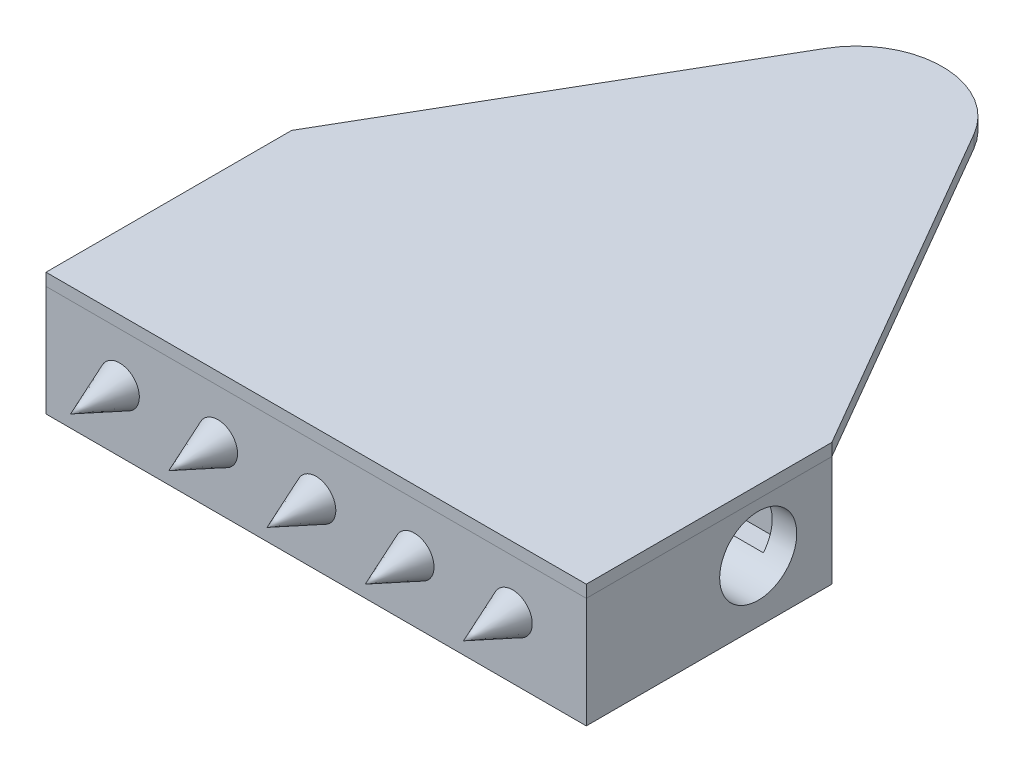
ISO-10303-21;
HEADER;
FILE_DESCRIPTION(('STEP AP214'),'2;1');
FILE_NAME('part.step','',(''),(''),'','','');
FILE_SCHEMA(('AUTOMOTIVE_DESIGN { 1 0 10303 214 1 1 1 1 }'));
ENDSEC;
DATA;
#1=APPLICATION_CONTEXT('core data for automotive mechanical design processes');
#2=APPLICATION_PROTOCOL_DEFINITION('international standard','automotive_design',2000,#1);
#3=PRODUCT_CONTEXT('',#1,'mechanical');
#4=PRODUCT('Part','Part','',(#3));
#5=PRODUCT_RELATED_PRODUCT_CATEGORY('part','',(#4));
#6=PRODUCT_DEFINITION_FORMATION('','',#4);
#7=PRODUCT_DEFINITION_CONTEXT('part definition',#1,'design');
#8=PRODUCT_DEFINITION('design','',#6,#7);
#9=PRODUCT_DEFINITION_SHAPE('','',#8);
#10=(LENGTH_UNIT() NAMED_UNIT(*) SI_UNIT(.MILLI.,.METRE.));
#11=(NAMED_UNIT(*) PLANE_ANGLE_UNIT() SI_UNIT($,.RADIAN.));
#12=(NAMED_UNIT(*) SI_UNIT($,.STERADIAN.) SOLID_ANGLE_UNIT());
#13=UNCERTAINTY_MEASURE_WITH_UNIT(LENGTH_MEASURE(1.E-05),#10,'distance_accuracy_value','');
#14=(GEOMETRIC_REPRESENTATION_CONTEXT(3) GLOBAL_UNCERTAINTY_ASSIGNED_CONTEXT((#13)) GLOBAL_UNIT_ASSIGNED_CONTEXT((#10,
#11,#12)) REPRESENTATION_CONTEXT('',''));
#15=CARTESIAN_POINT('',(0.,0.,0.));
#16=DIRECTION('',(0.,0.,1.));
#17=DIRECTION('',(1.,0.,0.));
#18=AXIS2_PLACEMENT_3D('',#15,#16,#17);
#19=CARTESIAN_POINT('',(0.,15.875,0.));
#20=DIRECTION('',(0.,-1.,0.));
#21=DIRECTION('',(0.,0.,-1.));
#22=AXIS2_PLACEMENT_3D('',#19,#20,#21);
#23=CYLINDRICAL_SURFACE('',#22,22.225);
#24=CARTESIAN_POINT('',(0.,12.7,0.));
#25=DIRECTION('',(0.,1.,0.));
#26=DIRECTION('',(0.,0.,-1.));
#27=AXIS2_PLACEMENT_3D('',#24,#25,#26);
#28=CIRCLE('',#27,22.225);
#29=CARTESIAN_POINT('',(19.2290160852544,12.7,-11.1443064114832));
#30=VERTEX_POINT('',#29);
#31=CARTESIAN_POINT('',(-19.2290160852544,12.7,-11.1443064114832));
#32=VERTEX_POINT('',#31);
#33=EDGE_CURVE('E130',#30,#32,#28,.T.);
#34=ORIENTED_EDGE('',*,*,#33,.T.);
#35=DIRECTION('',(0.,-1.,0.));
#36=VECTOR('',#35,1.);
#37=CARTESIAN_POINT('',(-19.2290160852544,15.875,-11.1443064114832));
#38=LINE('',#37,#36);
#39=CARTESIAN_POINT('',(-19.2290160852544,15.875,-11.1443064114832));
#40=VERTEX_POINT('',#39);
#41=EDGE_CURVE('E12',#40,#32,#38,.T.);
#42=ORIENTED_EDGE('',*,*,#41,.F.);
#43=CARTESIAN_POINT('',(0.,15.875,0.));
#44=DIRECTION('',(0.,1.,0.));
#45=DIRECTION('',(0.,0.,-1.));
#46=AXIS2_PLACEMENT_3D('',#43,#44,#45);
#47=CIRCLE('',#46,22.225);
#48=CARTESIAN_POINT('',(19.2290160852544,15.875,-11.1443064114832));
#49=VERTEX_POINT('',#48);
#50=EDGE_CURVE('E140',#49,#40,#47,.T.);
#51=ORIENTED_EDGE('',*,*,#50,.F.);
#52=DIRECTION('',(0.,-1.,0.));
#53=VECTOR('',#52,1.);
#54=CARTESIAN_POINT('',(19.2290160852544,15.875,-11.1443064114832));
#55=LINE('',#54,#53);
#56=EDGE_CURVE('E126',#49,#30,#55,.T.);
#57=ORIENTED_EDGE('',*,*,#56,.T.);
#58=EDGE_LOOP('',(#34,#42,#51,#57));
#59=FACE_BOUND('',#58,.T.);
#60=ADVANCED_FACE('F46',(#59),#23,.T.);
#61=CARTESIAN_POINT('',(-19.2290160852544,15.875,-11.1443064114832));
#62=DIRECTION('',(0.865197574139682,0.,0.501431109628042));
#63=DIRECTION('',(0.501431109628042,0.,-0.865197574139682));
#64=AXIS2_PLACEMENT_3D('',#61,#62,#63);
#65=PLANE('',#64);
#66=DIRECTION('',(-0.501431109628042,0.,0.865197574139682));
#67=VECTOR('',#66,1.);
#68=CARTESIAN_POINT('',(-19.2290160852544,12.7,-11.1443064114832));
#69=LINE('',#68,#67);
#70=CARTESIAN_POINT('',(-69.85,12.7,76.2));
#71=VERTEX_POINT('',#70);
#72=EDGE_CURVE('E133',#32,#71,#69,.T.);
#73=ORIENTED_EDGE('',*,*,#72,.T.);
#74=DIRECTION('',(0.,-1.,0.));
#75=VECTOR('',#74,1.);
#76=CARTESIAN_POINT('',(-69.85,15.875,76.2));
#77=LINE('',#76,#75);
#78=CARTESIAN_POINT('',(-69.85,15.875,76.2));
#79=VERTEX_POINT('',#78);
#80=EDGE_CURVE('E54',#79,#71,#77,.T.);
#81=ORIENTED_EDGE('',*,*,#80,.F.);
#82=DIRECTION('',(-0.501431109628042,0.,0.865197574139682));
#83=VECTOR('',#82,1.);
#84=CARTESIAN_POINT('',(-19.2290160852544,15.875,-11.1443064114832));
#85=LINE('',#84,#83);
#86=EDGE_CURVE('E99',#40,#79,#85,.T.);
#87=ORIENTED_EDGE('',*,*,#86,.F.);
#88=ORIENTED_EDGE('',*,*,#41,.T.);
#89=EDGE_LOOP('',(#73,#81,#87,#88));
#90=FACE_BOUND('',#89,.T.);
#91=ADVANCED_FACE('F164',(#90),#65,.F.);
#92=CARTESIAN_POINT('',(-69.85,15.875,76.2));
#93=DIRECTION('',(1.,0.,0.));
#94=DIRECTION('',(0.,0.,-1.));
#95=AXIS2_PLACEMENT_3D('',#92,#93,#94);
#96=PLANE('',#95);
#97=DIRECTION('',(0.,0.,1.));
#98=VECTOR('',#97,1.);
#99=CARTESIAN_POINT('',(-69.85,12.7,76.2));
#100=LINE('',#99,#98);
#101=CARTESIAN_POINT('',(-69.85,12.7,139.7));
#102=VERTEX_POINT('',#101);
#103=EDGE_CURVE('E135',#71,#102,#100,.T.);
#104=ORIENTED_EDGE('',*,*,#103,.T.);
#105=DIRECTION('',(0.,-1.,0.));
#106=VECTOR('',#105,1.);
#107=CARTESIAN_POINT('',(-69.85,15.875,139.7));
#108=LINE('',#107,#106);
#109=CARTESIAN_POINT('',(-69.85,15.875,139.7));
#110=VERTEX_POINT('',#109);
#111=EDGE_CURVE('E121',#110,#102,#108,.T.);
#112=ORIENTED_EDGE('',*,*,#111,.F.);
#113=DIRECTION('',(0.,0.,1.));
#114=VECTOR('',#113,1.);
#115=CARTESIAN_POINT('',(-69.85,15.875,76.2));
#116=LINE('',#115,#114);
#117=EDGE_CURVE('E112',#79,#110,#116,.T.);
#118=ORIENTED_EDGE('',*,*,#117,.F.);
#119=ORIENTED_EDGE('',*,*,#80,.T.);
#120=EDGE_LOOP('',(#104,#112,#118,#119));
#121=FACE_BOUND('',#120,.T.);
#122=ADVANCED_FACE('F146',(#121),#96,.F.);
#123=CARTESIAN_POINT('',(-69.85,15.875,139.7));
#124=DIRECTION('',(0.,0.,-1.));
#125=DIRECTION('',(-1.,0.,0.));
#126=AXIS2_PLACEMENT_3D('',#123,#124,#125);
#127=PLANE('',#126);
#128=DIRECTION('',(1.,0.,0.));
#129=VECTOR('',#128,1.);
#130=CARTESIAN_POINT('',(-69.85,12.7,139.7));
#131=LINE('',#130,#129);
#132=CARTESIAN_POINT('',(69.85,12.7,139.7));
#133=VERTEX_POINT('',#132);
#134=EDGE_CURVE('E120',#102,#133,#131,.T.);
#135=ORIENTED_EDGE('',*,*,#134,.T.);
#136=DIRECTION('',(0.,-1.,0.));
#137=VECTOR('',#136,1.);
#138=CARTESIAN_POINT('',(69.85,15.875,139.7));
#139=LINE('',#138,#137);
#140=CARTESIAN_POINT('',(69.85,15.875,139.7));
#141=VERTEX_POINT('',#140);
#142=EDGE_CURVE('E117',#141,#133,#139,.T.);
#143=ORIENTED_EDGE('',*,*,#142,.F.);
#144=DIRECTION('',(1.,0.,0.));
#145=VECTOR('',#144,1.);
#146=CARTESIAN_POINT('',(-69.85,15.875,139.7));
#147=LINE('',#146,#145);
#148=EDGE_CURVE('E106',#110,#141,#147,.T.);
#149=ORIENTED_EDGE('',*,*,#148,.F.);
#150=ORIENTED_EDGE('',*,*,#111,.T.);
#151=EDGE_LOOP('',(#135,#143,#149,#150));
#152=FACE_BOUND('',#151,.T.);
#153=ADVANCED_FACE('F118',(#152),#127,.F.);
#154=CARTESIAN_POINT('',(69.85,15.875,139.7));
#155=DIRECTION('',(-1.,0.,0.));
#156=DIRECTION('',(0.,0.,1.));
#157=AXIS2_PLACEMENT_3D('',#154,#155,#156);
#158=PLANE('',#157);
#159=DIRECTION('',(0.,0.,-1.));
#160=VECTOR('',#159,1.);
#161=CARTESIAN_POINT('',(69.85,12.7,139.7));
#162=LINE('',#161,#160);
#163=CARTESIAN_POINT('',(69.85,12.7,76.2));
#164=VERTEX_POINT('',#163);
#165=EDGE_CURVE('E85',#133,#164,#162,.T.);
#166=ORIENTED_EDGE('',*,*,#165,.T.);
#167=DIRECTION('',(0.,-1.,0.));
#168=VECTOR('',#167,1.);
#169=CARTESIAN_POINT('',(69.85,15.875,76.2));
#170=LINE('',#169,#168);
#171=CARTESIAN_POINT('',(69.85,15.875,76.2));
#172=VERTEX_POINT('',#171);
#173=EDGE_CURVE('E122',#172,#164,#170,.T.);
#174=ORIENTED_EDGE('',*,*,#173,.F.);
#175=DIRECTION('',(0.,0.,-1.));
#176=VECTOR('',#175,1.);
#177=CARTESIAN_POINT('',(69.85,15.875,139.7));
#178=LINE('',#177,#176);
#179=EDGE_CURVE('E110',#141,#172,#178,.T.);
#180=ORIENTED_EDGE('',*,*,#179,.F.);
#181=ORIENTED_EDGE('',*,*,#142,.T.);
#182=EDGE_LOOP('',(#166,#174,#180,#181));
#183=FACE_BOUND('',#182,.T.);
#184=ADVANCED_FACE('F124',(#183),#158,.F.);
#185=CARTESIAN_POINT('',(69.85,15.875,76.2));
#186=DIRECTION('',(-0.865197574139682,0.,0.501431109628042));
#187=DIRECTION('',(0.501431109628042,0.,0.865197574139682));
#188=AXIS2_PLACEMENT_3D('',#185,#186,#187);
#189=PLANE('',#188);
#190=DIRECTION('',(-0.501431109628042,0.,-0.865197574139682));
#191=VECTOR('',#190,1.);
#192=CARTESIAN_POINT('',(69.85,12.7,76.2));
#193=LINE('',#192,#191);
#194=EDGE_CURVE('E91',#164,#30,#193,.T.);
#195=ORIENTED_EDGE('',*,*,#194,.T.);
#196=ORIENTED_EDGE('',*,*,#56,.F.);
#197=DIRECTION('',(-0.501431109628042,0.,-0.865197574139682));
#198=VECTOR('',#197,1.);
#199=CARTESIAN_POINT('',(69.85,15.875,76.2));
#200=LINE('',#199,#198);
#201=EDGE_CURVE('E62',#172,#49,#200,.T.);
#202=ORIENTED_EDGE('',*,*,#201,.F.);
#203=ORIENTED_EDGE('',*,*,#173,.T.);
#204=EDGE_LOOP('',(#195,#196,#202,#203));
#205=FACE_BOUND('',#204,.T.);
#206=ADVANCED_FACE('F153',(#205),#189,.F.);
#207=CARTESIAN_POINT('',(0.,15.875,0.));
#208=DIRECTION('',(0.,-1.,0.));
#209=DIRECTION('',(0.,0.,-1.));
#210=AXIS2_PLACEMENT_3D('',#207,#208,#209);
#211=PLANE('',#210);
#212=ORIENTED_EDGE('',*,*,#50,.T.);
#213=ORIENTED_EDGE('',*,*,#86,.T.);
#214=ORIENTED_EDGE('',*,*,#117,.T.);
#215=ORIENTED_EDGE('',*,*,#148,.T.);
#216=ORIENTED_EDGE('',*,*,#179,.T.);
#217=ORIENTED_EDGE('',*,*,#201,.T.);
#218=EDGE_LOOP('',(#212,#213,#214,#215,#216,#217));
#219=FACE_BOUND('',#218,.T.);
#220=ADVANCED_FACE('F108',(#219),#211,.F.);
#221=CARTESIAN_POINT('',(0.,12.7,0.));
#222=DIRECTION('',(0.,-1.,0.));
#223=DIRECTION('',(0.,0.,-1.));
#224=AXIS2_PLACEMENT_3D('',#221,#222,#223);
#225=PLANE('',#224);
#226=ORIENTED_EDGE('',*,*,#33,.F.);
#227=ORIENTED_EDGE('',*,*,#194,.F.);
#228=ORIENTED_EDGE('',*,*,#165,.F.);
#229=ORIENTED_EDGE('',*,*,#134,.F.);
#230=ORIENTED_EDGE('',*,*,#103,.F.);
#231=ORIENTED_EDGE('',*,*,#72,.F.);
#232=EDGE_LOOP('',(#226,#227,#228,#229,#230,#231));
#233=FACE_BOUND('',#232,.T.);
#234=ADVANCED_FACE('F149',(#233),#225,.T.);
#235=CLOSED_SHELL('',(#60,#91,#122,#153,#184,#206,#220,#234));
#236=MANIFOLD_SOLID_BREP('B2',#235);
#237=CARTESIAN_POINT('',(0.,-6.35,0.));
#238=DIRECTION('',(0.,1.,0.));
#239=DIRECTION('',(0.,0.,1.));
#240=AXIS2_PLACEMENT_3D('',#237,#238,#239);
#241=PLANE('',#240);
#242=DIRECTION('',(-1.,0.,0.));
#243=VECTOR('',#242,1.);
#244=CARTESIAN_POINT('',(69.85,-6.35,87.5644011131208));
#245=LINE('',#244,#243);
#246=CARTESIAN_POINT('',(-19.05,-6.35,87.5644011131208));
#247=VERTEX_POINT('',#246);
#248=CARTESIAN_POINT('',(-63.5,-6.35,87.5644011131208));
#249=VERTEX_POINT('',#248);
#250=EDGE_CURVE('E552',#247,#249,#245,.T.);
#251=ORIENTED_EDGE('',*,*,#250,.F.);
#252=DIRECTION('',(0.,0.,-1.));
#253=VECTOR('',#252,1.);
#254=CARTESIAN_POINT('',(-19.05,-6.35,82.55));
#255=LINE('',#254,#253);
#256=CARTESIAN_POINT('',(-19.05,-6.35,82.55));
#257=VERTEX_POINT('',#256);
#258=EDGE_CURVE('E534',#247,#257,#255,.T.);
#259=ORIENTED_EDGE('',*,*,#258,.T.);
#260=DIRECTION('',(-1.,0.,0.));
#261=VECTOR('',#260,1.);
#262=CARTESIAN_POINT('',(-63.5,-6.35,82.55));
#263=LINE('',#262,#261);
#264=CARTESIAN_POINT('',(-63.5,-6.35,82.55));
#265=VERTEX_POINT('',#264);
#266=EDGE_CURVE('E536',#257,#265,#263,.T.);
#267=ORIENTED_EDGE('',*,*,#266,.T.);
#268=DIRECTION('',(0.,0.,1.));
#269=VECTOR('',#268,1.);
#270=CARTESIAN_POINT('',(-63.5,-6.35,82.55));
#271=LINE('',#270,#269);
#272=EDGE_CURVE('E522',#265,#249,#271,.T.);
#273=ORIENTED_EDGE('',*,*,#272,.T.);
#274=EDGE_LOOP('',(#251,#259,#267,#273));
#275=FACE_BOUND('',#274,.T.);
#276=ADVANCED_FACE('F221',(#275),#241,.T.);
#277=CARTESIAN_POINT('',(0.,-6.35,0.));
#278=DIRECTION('',(0.,-1.,0.));
#279=DIRECTION('',(0.,0.,-1.));
#280=AXIS2_PLACEMENT_3D('',#277,#278,#279);
#281=PLANE('',#280);
#282=DIRECTION('',(0.,0.,-1.));
#283=VECTOR('',#282,1.);
#284=CARTESIAN_POINT('',(63.5,-6.35,82.55));
#285=LINE('',#284,#283);
#286=CARTESIAN_POINT('',(63.5,-6.35,107.95));
#287=VERTEX_POINT('',#286);
#288=CARTESIAN_POINT('',(63.5,-6.35,102.935598886879));
#289=VERTEX_POINT('',#288);
#290=EDGE_CURVE('E558',#287,#289,#285,.T.);
#291=ORIENTED_EDGE('',*,*,#290,.T.);
#292=DIRECTION('',(-1.,0.,0.));
#293=VECTOR('',#292,1.);
#294=CARTESIAN_POINT('',(69.85,-6.35,102.935598886879));
#295=LINE('',#294,#293);
#296=CARTESIAN_POINT('',(19.05,-6.35,102.935598886879));
#297=VERTEX_POINT('',#296);
#298=EDGE_CURVE('E462',#289,#297,#295,.T.);
#299=ORIENTED_EDGE('',*,*,#298,.T.);
#300=DIRECTION('',(0.,0.,1.));
#301=VECTOR('',#300,1.);
#302=CARTESIAN_POINT('',(19.05,-6.35,82.55));
#303=LINE('',#302,#301);
#304=CARTESIAN_POINT('',(19.05,-6.35,107.95));
#305=VERTEX_POINT('',#304);
#306=EDGE_CURVE('E564',#297,#305,#303,.T.);
#307=ORIENTED_EDGE('',*,*,#306,.T.);
#308=DIRECTION('',(1.,0.,0.));
#309=VECTOR('',#308,1.);
#310=CARTESIAN_POINT('',(63.5,-6.35,107.95));
#311=LINE('',#310,#309);
#312=EDGE_CURVE('E568',#305,#287,#311,.T.);
#313=ORIENTED_EDGE('',*,*,#312,.T.);
#314=EDGE_LOOP('',(#291,#299,#307,#313));
#315=FACE_BOUND('',#314,.T.);
#316=ADVANCED_FACE('F479',(#315),#281,.F.);
#317=CARTESIAN_POINT('',(-63.5,12.7,82.55));
#318=DIRECTION('',(0.,0.,1.));
#319=DIRECTION('',(1.,0.,0.));
#320=AXIS2_PLACEMENT_3D('',#317,#318,#319);
#321=PLANE('',#320);
#322=DIRECTION('',(-1.,0.,0.));
#323=VECTOR('',#322,1.);
#324=CARTESIAN_POINT('',(-63.5,-12.7,82.55));
#325=LINE('',#324,#323);
#326=CARTESIAN_POINT('',(19.05,-12.7,82.55));
#327=VERTEX_POINT('',#326);
#328=CARTESIAN_POINT('',(-19.05,-12.7,82.55));
#329=VERTEX_POINT('',#328);
#330=EDGE_CURVE('E420',#327,#329,#325,.T.);
#331=ORIENTED_EDGE('',*,*,#330,.F.);
#332=DIRECTION('',(0.,-1.,0.));
#333=VECTOR('',#332,1.);
#334=CARTESIAN_POINT('',(19.05,-6.35,82.55));
#335=LINE('',#334,#333);
#336=CARTESIAN_POINT('',(19.05,-6.35,82.55));
#337=VERTEX_POINT('',#336);
#338=EDGE_CURVE('E531',#337,#327,#335,.T.);
#339=ORIENTED_EDGE('',*,*,#338,.F.);
#340=DIRECTION('',(-1.,0.,0.));
#341=VECTOR('',#340,1.);
#342=CARTESIAN_POINT('',(63.5,-6.35,82.55));
#343=LINE('',#342,#341);
#344=CARTESIAN_POINT('',(63.5,-6.35,82.55));
#345=VERTEX_POINT('',#344);
#346=EDGE_CURVE('E561',#345,#337,#343,.T.);
#347=ORIENTED_EDGE('',*,*,#346,.F.);
#348=DIRECTION('',(0.,-1.,0.));
#349=VECTOR('',#348,1.);
#350=CARTESIAN_POINT('',(63.5,12.7,82.55));
#351=LINE('',#350,#349);
#352=CARTESIAN_POINT('',(63.5,12.7,82.55));
#353=VERTEX_POINT('',#352);
#354=EDGE_CURVE('E445',#353,#345,#351,.T.);
#355=ORIENTED_EDGE('',*,*,#354,.F.);
#356=DIRECTION('',(-1.,0.,0.));
#357=VECTOR('',#356,1.);
#358=CARTESIAN_POINT('',(-63.5,12.7,82.55));
#359=LINE('',#358,#357);
#360=CARTESIAN_POINT('',(-63.5,12.7,82.55));
#361=VERTEX_POINT('',#360);
#362=EDGE_CURVE('E429',#353,#361,#359,.T.);
#363=ORIENTED_EDGE('',*,*,#362,.T.);
#364=DIRECTION('',(0.,-1.,0.));
#365=VECTOR('',#364,1.);
#366=CARTESIAN_POINT('',(-63.5,12.7,82.55));
#367=LINE('',#366,#365);
#368=EDGE_CURVE('E442',#361,#265,#367,.T.);
#369=ORIENTED_EDGE('',*,*,#368,.T.);
#370=ORIENTED_EDGE('',*,*,#266,.F.);
#371=DIRECTION('',(0.,-1.,0.));
#372=VECTOR('',#371,1.);
#373=CARTESIAN_POINT('',(-19.05,-6.35,82.55));
#374=LINE('',#373,#372);
#375=EDGE_CURVE('E539',#257,#329,#374,.T.);
#376=ORIENTED_EDGE('',*,*,#375,.T.);
#377=EDGE_LOOP('',(#331,#339,#347,#355,#363,#369,#370,#376));
#378=FACE_BOUND('',#377,.T.);
#379=ADVANCED_FACE('F486',(#378),#321,.T.);
#380=CARTESIAN_POINT('',(0.,-12.7,0.));
#381=DIRECTION('',(0.,-1.,0.));
#382=DIRECTION('',(0.,0.,-1.));
#383=AXIS2_PLACEMENT_3D('',#380,#381,#382);
#384=PLANE('',#383);
#385=DIRECTION('',(0.,0.,1.));
#386=VECTOR('',#385,1.);
#387=CARTESIAN_POINT('',(19.05,-12.7,82.55));
#388=LINE('',#387,#386);
#389=CARTESIAN_POINT('',(19.05,-12.7,107.95));
#390=VERTEX_POINT('',#389);
#391=EDGE_CURVE('E557',#327,#390,#388,.T.);
#392=ORIENTED_EDGE('',*,*,#391,.F.);
#393=ORIENTED_EDGE('',*,*,#330,.T.);
#394=DIRECTION('',(0.,0.,-1.));
#395=VECTOR('',#394,1.);
#396=CARTESIAN_POINT('',(-19.05,-12.7,82.55));
#397=LINE('',#396,#395);
#398=CARTESIAN_POINT('',(-19.05,-12.7,107.95));
#399=VERTEX_POINT('',#398);
#400=EDGE_CURVE('E523',#399,#329,#397,.T.);
#401=ORIENTED_EDGE('',*,*,#400,.F.);
#402=DIRECTION('',(1.,0.,0.));
#403=VECTOR('',#402,1.);
#404=CARTESIAN_POINT('',(-63.5,-12.7,107.95));
#405=LINE('',#404,#403);
#406=CARTESIAN_POINT('',(-63.5,-12.7,107.95));
#407=VERTEX_POINT('',#406);
#408=EDGE_CURVE('E527',#407,#399,#405,.T.);
#409=ORIENTED_EDGE('',*,*,#408,.F.);
#410=DIRECTION('',(0.,0.,1.));
#411=VECTOR('',#410,1.);
#412=CARTESIAN_POINT('',(-63.5,-12.7,82.55));
#413=LINE('',#412,#411);
#414=CARTESIAN_POINT('',(-63.5,-12.7,133.35));
#415=VERTEX_POINT('',#414);
#416=EDGE_CURVE('E422',#407,#415,#413,.T.);
#417=ORIENTED_EDGE('',*,*,#416,.T.);
#418=DIRECTION('',(1.,0.,0.));
#419=VECTOR('',#418,1.);
#420=CARTESIAN_POINT('',(-63.5,-12.7,133.35));
#421=LINE('',#420,#419);
#422=CARTESIAN_POINT('',(63.5,-12.7,133.35));
#423=VERTEX_POINT('',#422);
#424=EDGE_CURVE('E424',#415,#423,#421,.T.);
#425=ORIENTED_EDGE('',*,*,#424,.T.);
#426=DIRECTION('',(0.,0.,-1.));
#427=VECTOR('',#426,1.);
#428=CARTESIAN_POINT('',(63.5,-12.7,82.55));
#429=LINE('',#428,#427);
#430=CARTESIAN_POINT('',(63.5,-12.7,107.95));
#431=VERTEX_POINT('',#430);
#432=EDGE_CURVE('E414',#423,#431,#429,.T.);
#433=ORIENTED_EDGE('',*,*,#432,.T.);
#434=DIRECTION('',(1.,0.,0.));
#435=VECTOR('',#434,1.);
#436=CARTESIAN_POINT('',(63.5,-12.7,107.95));
#437=LINE('',#436,#435);
#438=EDGE_CURVE('E573',#390,#431,#437,.T.);
#439=ORIENTED_EDGE('',*,*,#438,.F.);
#440=EDGE_LOOP('',(#392,#393,#401,#409,#417,#425,#433,#439));
#441=FACE_BOUND('',#440,.T.);
#442=ADVANCED_FACE('F591',(#441),#384,.F.);
#443=CARTESIAN_POINT('',(63.5,12.7,82.55));
#444=DIRECTION('',(-1.,0.,0.));
#445=DIRECTION('',(0.,0.,1.));
#446=AXIS2_PLACEMENT_3D('',#443,#444,#445);
#447=PLANE('',#446);
#448=CARTESIAN_POINT('',(63.5,0.,95.2500000000001));
#449=DIRECTION('',(-1.,0.,0.));
#450=DIRECTION('',(0.,0.,1.));
#451=AXIS2_PLACEMENT_3D('',#448,#449,#450);
#452=CIRCLE('',#451,9.9695);
#453=CARTESIAN_POINT('',(63.5,-6.35,87.5644011131208));
#454=VERTEX_POINT('',#453);
#455=EDGE_CURVE('E244',#289,#454,#452,.T.);
#456=ORIENTED_EDGE('',*,*,#455,.F.);
#457=ORIENTED_EDGE('',*,*,#290,.F.);
#458=DIRECTION('',(0.,-1.,0.));
#459=VECTOR('',#458,1.);
#460=CARTESIAN_POINT('',(63.5,-6.35,107.95));
#461=LINE('',#460,#459);
#462=EDGE_CURVE('E571',#287,#431,#461,.T.);
#463=ORIENTED_EDGE('',*,*,#462,.T.);
#464=ORIENTED_EDGE('',*,*,#432,.F.);
#465=DIRECTION('',(0.,-1.,0.));
#466=VECTOR('',#465,1.);
#467=CARTESIAN_POINT('',(63.5,12.7,133.35));
#468=LINE('',#467,#466);
#469=CARTESIAN_POINT('',(63.5,12.7,133.35));
#470=VERTEX_POINT('',#469);
#471=EDGE_CURVE('E436',#470,#423,#468,.T.);
#472=ORIENTED_EDGE('',*,*,#471,.F.);
#473=DIRECTION('',(0.,0.,-1.));
#474=VECTOR('',#473,1.);
#475=CARTESIAN_POINT('',(63.5,12.7,82.55));
#476=LINE('',#475,#474);
#477=EDGE_CURVE('E427',#470,#353,#476,.T.);
#478=ORIENTED_EDGE('',*,*,#477,.T.);
#479=ORIENTED_EDGE('',*,*,#354,.T.);
#480=EDGE_CURVE('E562',#454,#345,#285,.T.);
#481=ORIENTED_EDGE('',*,*,#480,.F.);
#482=EDGE_LOOP('',(#456,#457,#463,#464,#472,#478,#479,#481));
#483=FACE_BOUND('',#482,.T.);
#484=ADVANCED_FACE('F600',(#483),#447,.T.);
#485=CARTESIAN_POINT('',(-63.5,12.7,82.55));
#486=DIRECTION('',(1.,0.,0.));
#487=DIRECTION('',(0.,0.,-1.));
#488=AXIS2_PLACEMENT_3D('',#485,#486,#487);
#489=PLANE('',#488);
#490=CARTESIAN_POINT('',(-63.5,0.,95.25));
#491=DIRECTION('',(1.,0.,0.));
#492=DIRECTION('',(0.,0.,-1.));
#493=AXIS2_PLACEMENT_3D('',#490,#491,#492);
#494=CIRCLE('',#493,9.9695);
#495=CARTESIAN_POINT('',(-63.5,-6.35,102.935598886879));
#496=VERTEX_POINT('',#495);
#497=EDGE_CURVE('E236',#249,#496,#494,.T.);
#498=ORIENTED_EDGE('',*,*,#497,.F.);
#499=ORIENTED_EDGE('',*,*,#272,.F.);
#500=ORIENTED_EDGE('',*,*,#368,.F.);
#501=DIRECTION('',(0.,0.,1.));
#502=VECTOR('',#501,1.);
#503=CARTESIAN_POINT('',(-63.5,12.7,82.55));
#504=LINE('',#503,#502);
#505=CARTESIAN_POINT('',(-63.5,12.7,133.35));
#506=VERTEX_POINT('',#505);
#507=EDGE_CURVE('E431',#361,#506,#504,.T.);
#508=ORIENTED_EDGE('',*,*,#507,.T.);
#509=DIRECTION('',(0.,-1.,0.));
#510=VECTOR('',#509,1.);
#511=CARTESIAN_POINT('',(-63.5,12.7,133.35));
#512=LINE('',#511,#510);
#513=EDGE_CURVE('E439',#506,#415,#512,.T.);
#514=ORIENTED_EDGE('',*,*,#513,.T.);
#515=ORIENTED_EDGE('',*,*,#416,.F.);
#516=DIRECTION('',(0.,-1.,0.));
#517=VECTOR('',#516,1.);
#518=CARTESIAN_POINT('',(-63.5,-6.35,107.95));
#519=LINE('',#518,#517);
#520=CARTESIAN_POINT('',(-63.5,-6.35,107.95));
#521=VERTEX_POINT('',#520);
#522=EDGE_CURVE('E520',#521,#407,#519,.T.);
#523=ORIENTED_EDGE('',*,*,#522,.F.);
#524=EDGE_CURVE('E508',#496,#521,#271,.T.);
#525=ORIENTED_EDGE('',*,*,#524,.F.);
#526=EDGE_LOOP('',(#498,#499,#500,#508,#514,#515,#523,#525));
#527=FACE_BOUND('',#526,.T.);
#528=ADVANCED_FACE('F516',(#527),#489,.T.);
#529=CARTESIAN_POINT('',(0.,12.7,0.));
#530=DIRECTION('',(0.,-1.,0.));
#531=DIRECTION('',(0.,0.,-1.));
#532=AXIS2_PLACEMENT_3D('',#529,#530,#531);
#533=PLANE('',#532);
#534=DIRECTION('',(0.,0.,-1.));
#535=VECTOR('',#534,1.);
#536=CARTESIAN_POINT('',(69.85,12.7,139.7));
#537=LINE('',#536,#535);
#538=CARTESIAN_POINT('',(69.85,12.7,139.7));
#539=VERTEX_POINT('',#538);
#540=CARTESIAN_POINT('',(69.85,12.7,76.2));
#541=VERTEX_POINT('',#540);
#542=EDGE_CURVE('E448',#539,#541,#537,.T.);
#543=ORIENTED_EDGE('',*,*,#542,.T.);
#544=DIRECTION('',(-1.,0.,0.));
#545=VECTOR('',#544,1.);
#546=CARTESIAN_POINT('',(-69.85,12.7,76.2));
#547=LINE('',#546,#545);
#548=CARTESIAN_POINT('',(-69.85,12.7,76.2));
#549=VERTEX_POINT('',#548);
#550=EDGE_CURVE('E451',#541,#549,#547,.T.);
#551=ORIENTED_EDGE('',*,*,#550,.T.);
#552=DIRECTION('',(0.,0.,1.));
#553=VECTOR('',#552,1.);
#554=CARTESIAN_POINT('',(-69.85,12.7,139.7));
#555=LINE('',#554,#553);
#556=CARTESIAN_POINT('',(-69.85,12.7,139.7));
#557=VERTEX_POINT('',#556);
#558=EDGE_CURVE('E453',#549,#557,#555,.T.);
#559=ORIENTED_EDGE('',*,*,#558,.T.);
#560=DIRECTION('',(1.,0.,0.));
#561=VECTOR('',#560,1.);
#562=CARTESIAN_POINT('',(-69.85,12.7,139.7));
#563=LINE('',#562,#561);
#564=EDGE_CURVE('E395',#557,#539,#563,.T.);
#565=ORIENTED_EDGE('',*,*,#564,.T.);
#566=EDGE_LOOP('',(#543,#551,#559,#565));
#567=FACE_BOUND('',#566,.T.);
#568=ORIENTED_EDGE('',*,*,#477,.F.);
#569=DIRECTION('',(1.,0.,0.));
#570=VECTOR('',#569,1.);
#571=CARTESIAN_POINT('',(-63.5,12.7,133.35));
#572=LINE('',#571,#570);
#573=EDGE_CURVE('E434',#506,#470,#572,.T.);
#574=ORIENTED_EDGE('',*,*,#573,.F.);
#575=ORIENTED_EDGE('',*,*,#507,.F.);
#576=ORIENTED_EDGE('',*,*,#362,.F.);
#577=EDGE_LOOP('',(#568,#574,#575,#576));
#578=FACE_BOUND('',#577,.T.);
#579=ADVANCED_FACE('F611',(#567,#578),#533,.F.);
#580=CARTESIAN_POINT('',(69.85,12.7,139.7));
#581=DIRECTION('',(-1.,0.,0.));
#582=DIRECTION('',(0.,0.,1.));
#583=AXIS2_PLACEMENT_3D('',#580,#581,#582);
#584=PLANE('',#583);
#585=CARTESIAN_POINT('',(69.85,0.,95.2500000000001));
#586=DIRECTION('',(-1.,0.,0.));
#587=DIRECTION('',(0.,0.,1.));
#588=AXIS2_PLACEMENT_3D('',#585,#586,#587);
#589=CIRCLE('',#588,9.9695);
#590=CARTESIAN_POINT('',(69.85,0.,105.2195));
#591=VERTEX_POINT('',#590);
#592=EDGE_CURVE('E604',#591,#591,#589,.T.);
#593=ORIENTED_EDGE('',*,*,#592,.T.);
#594=EDGE_LOOP('',(#593));
#595=FACE_BOUND('',#594,.T.);
#596=DIRECTION('',(0.,-1.,0.));
#597=VECTOR('',#596,1.);
#598=CARTESIAN_POINT('',(69.85,12.7,139.7));
#599=LINE('',#598,#597);
#600=CARTESIAN_POINT('',(69.85,-15.875,139.7));
#601=VERTEX_POINT('',#600);
#602=EDGE_CURVE('E400',#539,#601,#599,.T.);
#603=ORIENTED_EDGE('',*,*,#602,.T.);
#604=DIRECTION('',(0.,0.,1.));
#605=VECTOR('',#604,1.);
#606=CARTESIAN_POINT('',(69.85,-15.875,139.7));
#607=LINE('',#606,#605);
#608=CARTESIAN_POINT('',(69.85,-15.875,76.2));
#609=VERTEX_POINT('',#608);
#610=EDGE_CURVE('E409',#609,#601,#607,.T.);
#611=ORIENTED_EDGE('',*,*,#610,.F.);
#612=DIRECTION('',(0.,-1.,0.));
#613=VECTOR('',#612,1.);
#614=CARTESIAN_POINT('',(69.85,12.7,76.2));
#615=LINE('',#614,#613);
#616=EDGE_CURVE('E458',#541,#609,#615,.T.);
#617=ORIENTED_EDGE('',*,*,#616,.F.);
#618=ORIENTED_EDGE('',*,*,#542,.F.);
#619=EDGE_LOOP('',(#603,#611,#617,#618));
#620=FACE_BOUND('',#619,.T.);
#621=ADVANCED_FACE('F223',(#595,#620),#584,.F.);
#622=CARTESIAN_POINT('',(-69.85,12.7,76.2));
#623=DIRECTION('',(0.,0.,1.));
#624=DIRECTION('',(1.,0.,0.));
#625=AXIS2_PLACEMENT_3D('',#622,#623,#624);
#626=PLANE('',#625);
#627=ORIENTED_EDGE('',*,*,#616,.T.);
#628=DIRECTION('',(1.,0.,0.));
#629=VECTOR('',#628,1.);
#630=CARTESIAN_POINT('',(-69.85,-15.875,76.2));
#631=LINE('',#630,#629);
#632=CARTESIAN_POINT('',(-69.85,-15.875,76.2));
#633=VERTEX_POINT('',#632);
#634=EDGE_CURVE('E412',#633,#609,#631,.T.);
#635=ORIENTED_EDGE('',*,*,#634,.F.);
#636=DIRECTION('',(0.,-1.,0.));
#637=VECTOR('',#636,1.);
#638=CARTESIAN_POINT('',(-69.85,12.7,76.2));
#639=LINE('',#638,#637);
#640=EDGE_CURVE('E399',#549,#633,#639,.T.);
#641=ORIENTED_EDGE('',*,*,#640,.F.);
#642=ORIENTED_EDGE('',*,*,#550,.F.);
#643=EDGE_LOOP('',(#627,#635,#641,#642));
#644=FACE_BOUND('',#643,.T.);
#645=ADVANCED_FACE('F745',(#644),#626,.F.);
#646=CARTESIAN_POINT('',(-69.85,12.7,139.7));
#647=DIRECTION('',(1.,0.,0.));
#648=DIRECTION('',(0.,0.,-1.));
#649=AXIS2_PLACEMENT_3D('',#646,#647,#648);
#650=PLANE('',#649);
#651=CARTESIAN_POINT('',(-69.85,0.,95.25));
#652=DIRECTION('',(-1.,0.,0.));
#653=DIRECTION('',(0.,0.,1.));
#654=AXIS2_PLACEMENT_3D('',#651,#652,#653);
#655=CIRCLE('',#654,9.9695);
#656=CARTESIAN_POINT('',(-69.85,0.,105.2195));
#657=VERTEX_POINT('',#656);
#658=EDGE_CURVE('E620',#657,#657,#655,.T.);
#659=ORIENTED_EDGE('',*,*,#658,.F.);
#660=EDGE_LOOP('',(#659));
#661=FACE_BOUND('',#660,.T.);
#662=ORIENTED_EDGE('',*,*,#640,.T.);
#663=DIRECTION('',(0.,0.,-1.));
#664=VECTOR('',#663,1.);
#665=CARTESIAN_POINT('',(-69.85,-15.875,139.7));
#666=LINE('',#665,#664);
#667=CARTESIAN_POINT('',(-69.85,-15.875,139.7));
#668=VERTEX_POINT('',#667);
#669=EDGE_CURVE('E406',#668,#633,#666,.T.);
#670=ORIENTED_EDGE('',*,*,#669,.F.);
#671=DIRECTION('',(0.,-1.,0.));
#672=VECTOR('',#671,1.);
#673=CARTESIAN_POINT('',(-69.85,12.7,139.7));
#674=LINE('',#673,#672);
#675=EDGE_CURVE('E390',#557,#668,#674,.T.);
#676=ORIENTED_EDGE('',*,*,#675,.F.);
#677=ORIENTED_EDGE('',*,*,#558,.F.);
#678=EDGE_LOOP('',(#662,#670,#676,#677));
#679=FACE_BOUND('',#678,.T.);
#680=ADVANCED_FACE('F370',(#661,#679),#650,.F.);
#681=CARTESIAN_POINT('',(-69.85,12.7,139.7));
#682=DIRECTION('',(0.,0.,-1.));
#683=DIRECTION('',(-1.,0.,0.));
#684=AXIS2_PLACEMENT_3D('',#681,#682,#683);
#685=PLANE('',#684);
#686=CARTESIAN_POINT('',(-50.8,0.,139.7));
#687=DIRECTION('',(0.,0.,-1.));
#688=DIRECTION('',(-1.,0.,0.));
#689=AXIS2_PLACEMENT_3D('',#686,#687,#688);
#690=CIRCLE('',#689,5.08);
#691=CARTESIAN_POINT('',(-55.88,0.,139.7));
#692=VERTEX_POINT('',#691);
#693=EDGE_CURVE('E44',#692,#692,#690,.F.);
#694=ORIENTED_EDGE('',*,*,#693,.F.);
#695=EDGE_LOOP('',(#694));
#696=FACE_BOUND('',#695,.T.);
#697=CARTESIAN_POINT('',(-25.4,0.,139.7));
#698=DIRECTION('',(0.,0.,-1.));
#699=DIRECTION('',(-1.,0.,0.));
#700=AXIS2_PLACEMENT_3D('',#697,#698,#699);
#701=CIRCLE('',#700,5.08);
#702=CARTESIAN_POINT('',(-30.48,0.,139.7));
#703=VERTEX_POINT('',#702);
#704=EDGE_CURVE('E229',#703,#703,#701,.F.);
#705=ORIENTED_EDGE('',*,*,#704,.F.);
#706=EDGE_LOOP('',(#705));
#707=FACE_BOUND('',#706,.T.);
#708=CARTESIAN_POINT('',(50.8,0.,139.7));
#709=DIRECTION('',(0.,0.,-1.));
#710=DIRECTION('',(-1.,0.,0.));
#711=AXIS2_PLACEMENT_3D('',#708,#709,#710);
#712=CIRCLE('',#711,5.08);
#713=CARTESIAN_POINT('',(45.72,0.,139.7));
#714=VERTEX_POINT('',#713);
#715=EDGE_CURVE('E378',#714,#714,#712,.F.);
#716=ORIENTED_EDGE('',*,*,#715,.F.);
#717=EDGE_LOOP('',(#716));
#718=FACE_BOUND('',#717,.T.);
#719=CARTESIAN_POINT('',(25.4,0.,139.7));
#720=DIRECTION('',(0.,0.,-1.));
#721=DIRECTION('',(-1.,0.,0.));
#722=AXIS2_PLACEMENT_3D('',#719,#720,#721);
#723=CIRCLE('',#722,5.08);
#724=CARTESIAN_POINT('',(20.32,0.,139.7));
#725=VERTEX_POINT('',#724);
#726=EDGE_CURVE('E382',#725,#725,#723,.F.);
#727=ORIENTED_EDGE('',*,*,#726,.F.);
#728=EDGE_LOOP('',(#727));
#729=FACE_BOUND('',#728,.T.);
#730=CARTESIAN_POINT('',(0.,0.,139.7));
#731=DIRECTION('',(0.,0.,-1.));
#732=DIRECTION('',(-1.,0.,0.));
#733=AXIS2_PLACEMENT_3D('',#730,#731,#732);
#734=CIRCLE('',#733,5.08);
#735=CARTESIAN_POINT('',(-5.08,0.,139.7));
#736=VERTEX_POINT('',#735);
#737=EDGE_CURVE('E386',#736,#736,#734,.F.);
#738=ORIENTED_EDGE('',*,*,#737,.F.);
#739=EDGE_LOOP('',(#738));
#740=FACE_BOUND('',#739,.T.);
#741=ORIENTED_EDGE('',*,*,#675,.T.);
#742=DIRECTION('',(-1.,0.,0.));
#743=VECTOR('',#742,1.);
#744=CARTESIAN_POINT('',(-69.85,-15.875,139.7));
#745=LINE('',#744,#743);
#746=EDGE_CURVE('E393',#601,#668,#745,.T.);
#747=ORIENTED_EDGE('',*,*,#746,.F.);
#748=ORIENTED_EDGE('',*,*,#602,.F.);
#749=ORIENTED_EDGE('',*,*,#564,.F.);
#750=EDGE_LOOP('',(#741,#747,#748,#749));
#751=FACE_BOUND('',#750,.T.);
#752=ADVANCED_FACE('F366',(#696,#707,#718,#729,#740,#751),#685,.F.);
#753=CARTESIAN_POINT('',(-63.5,12.7,133.35));
#754=DIRECTION('',(0.,0.,-1.));
#755=DIRECTION('',(-1.,0.,0.));
#756=AXIS2_PLACEMENT_3D('',#753,#754,#755);
#757=PLANE('',#756);
#758=ORIENTED_EDGE('',*,*,#471,.T.);
#759=ORIENTED_EDGE('',*,*,#424,.F.);
#760=ORIENTED_EDGE('',*,*,#513,.F.);
#761=ORIENTED_EDGE('',*,*,#573,.T.);
#762=EDGE_LOOP('',(#758,#759,#760,#761));
#763=FACE_BOUND('',#762,.T.);
#764=ADVANCED_FACE('F369',(#763),#757,.T.);
#765=CARTESIAN_POINT('',(0.,-15.875,0.));
#766=DIRECTION('',(0.,-1.,0.));
#767=DIRECTION('',(0.,0.,-1.));
#768=AXIS2_PLACEMENT_3D('',#765,#766,#767);
#769=PLANE('',#768);
#770=ORIENTED_EDGE('',*,*,#610,.T.);
#771=ORIENTED_EDGE('',*,*,#746,.T.);
#772=ORIENTED_EDGE('',*,*,#669,.T.);
#773=ORIENTED_EDGE('',*,*,#634,.T.);
#774=EDGE_LOOP('',(#770,#771,#772,#773));
#775=FACE_BOUND('',#774,.T.);
#776=ADVANCED_FACE('F404',(#775),#769,.T.);
#777=CARTESIAN_POINT('',(-63.5,-6.35,107.95));
#778=DIRECTION('',(0.,0.,-1.));
#779=DIRECTION('',(-1.,0.,0.));
#780=AXIS2_PLACEMENT_3D('',#777,#778,#779);
#781=PLANE('',#780);
#782=ORIENTED_EDGE('',*,*,#408,.T.);
#783=DIRECTION('',(0.,-1.,0.));
#784=VECTOR('',#783,1.);
#785=CARTESIAN_POINT('',(-19.05,-6.35,107.95));
#786=LINE('',#785,#784);
#787=CARTESIAN_POINT('',(-19.05,-6.35,107.95));
#788=VERTEX_POINT('',#787);
#789=EDGE_CURVE('E544',#788,#399,#786,.T.);
#790=ORIENTED_EDGE('',*,*,#789,.F.);
#791=DIRECTION('',(1.,0.,0.));
#792=VECTOR('',#791,1.);
#793=CARTESIAN_POINT('',(-63.5,-6.35,107.95));
#794=LINE('',#793,#792);
#795=EDGE_CURVE('E525',#521,#788,#794,.T.);
#796=ORIENTED_EDGE('',*,*,#795,.F.);
#797=ORIENTED_EDGE('',*,*,#522,.T.);
#798=EDGE_LOOP('',(#782,#790,#796,#797));
#799=FACE_BOUND('',#798,.T.);
#800=ADVANCED_FACE('F503',(#799),#781,.F.);
#801=CARTESIAN_POINT('',(-19.05,-6.35,82.55));
#802=DIRECTION('',(-1.,0.,0.));
#803=DIRECTION('',(0.,0.,1.));
#804=AXIS2_PLACEMENT_3D('',#801,#802,#803);
#805=PLANE('',#804);
#806=ORIENTED_EDGE('',*,*,#258,.F.);
#807=CARTESIAN_POINT('',(-19.05,0.,95.25));
#808=DIRECTION('',(-1.,0.,0.));
#809=DIRECTION('',(0.,0.,1.));
#810=AXIS2_PLACEMENT_3D('',#807,#808,#809);
#811=CIRCLE('',#810,9.9695);
#812=CARTESIAN_POINT('',(-19.05,-6.35,102.935598886879));
#813=VERTEX_POINT('',#812);
#814=EDGE_CURVE('E513',#247,#813,#811,.T.);
#815=ORIENTED_EDGE('',*,*,#814,.T.);
#816=EDGE_CURVE('E511',#788,#813,#255,.T.);
#817=ORIENTED_EDGE('',*,*,#816,.F.);
#818=ORIENTED_EDGE('',*,*,#789,.T.);
#819=ORIENTED_EDGE('',*,*,#400,.T.);
#820=ORIENTED_EDGE('',*,*,#375,.F.);
#821=EDGE_LOOP('',(#806,#815,#817,#818,#819,#820));
#822=FACE_BOUND('',#821,.T.);
#823=ADVANCED_FACE('F495',(#822),#805,.F.);
#824=DIRECTION('',(-1.,0.,0.));
#825=VECTOR('',#824,1.);
#826=CARTESIAN_POINT('',(69.85,-6.35,102.935598886879));
#827=LINE('',#826,#825);
#828=EDGE_CURVE('E506',#496,#813,#827,.F.);
#829=ORIENTED_EDGE('',*,*,#828,.F.);
#830=ORIENTED_EDGE('',*,*,#524,.T.);
#831=ORIENTED_EDGE('',*,*,#795,.T.);
#832=ORIENTED_EDGE('',*,*,#816,.T.);
#833=EDGE_LOOP('',(#829,#830,#831,#832));
#834=FACE_BOUND('',#833,.T.);
#835=ADVANCED_FACE('F482',(#834),#241,.T.);
#836=CARTESIAN_POINT('',(19.05,-6.35,82.55));
#837=DIRECTION('',(1.,0.,0.));
#838=DIRECTION('',(0.,0.,-1.));
#839=AXIS2_PLACEMENT_3D('',#836,#837,#838);
#840=PLANE('',#839);
#841=ORIENTED_EDGE('',*,*,#306,.F.);
#842=CARTESIAN_POINT('',(19.05,0.,95.25));
#843=DIRECTION('',(1.,0.,0.));
#844=DIRECTION('',(0.,0.,-1.));
#845=AXIS2_PLACEMENT_3D('',#842,#843,#844);
#846=CIRCLE('',#845,9.9695);
#847=CARTESIAN_POINT('',(19.05,-6.35,87.5644011131208));
#848=VERTEX_POINT('',#847);
#849=EDGE_CURVE('E603',#297,#848,#846,.T.);
#850=ORIENTED_EDGE('',*,*,#849,.T.);
#851=EDGE_CURVE('E565',#337,#848,#303,.T.);
#852=ORIENTED_EDGE('',*,*,#851,.F.);
#853=ORIENTED_EDGE('',*,*,#338,.T.);
#854=ORIENTED_EDGE('',*,*,#391,.T.);
#855=DIRECTION('',(0.,-1.,0.));
#856=VECTOR('',#855,1.);
#857=CARTESIAN_POINT('',(19.05,-6.35,107.95));
#858=LINE('',#857,#856);
#859=EDGE_CURVE('E576',#305,#390,#858,.T.);
#860=ORIENTED_EDGE('',*,*,#859,.F.);
#861=EDGE_LOOP('',(#841,#850,#852,#853,#854,#860));
#862=FACE_BOUND('',#861,.T.);
#863=ADVANCED_FACE('F494',(#862),#840,.F.);
#864=CARTESIAN_POINT('',(63.5,-6.35,107.95));
#865=DIRECTION('',(0.,0.,-1.));
#866=DIRECTION('',(-1.,0.,0.));
#867=AXIS2_PLACEMENT_3D('',#864,#865,#866);
#868=PLANE('',#867);
#869=ORIENTED_EDGE('',*,*,#438,.T.);
#870=ORIENTED_EDGE('',*,*,#462,.F.);
#871=ORIENTED_EDGE('',*,*,#312,.F.);
#872=ORIENTED_EDGE('',*,*,#859,.T.);
#873=EDGE_LOOP('',(#869,#870,#871,#872));
#874=FACE_BOUND('',#873,.T.);
#875=ADVANCED_FACE('F501',(#874),#868,.F.);
#876=ORIENTED_EDGE('',*,*,#851,.T.);
#877=DIRECTION('',(-1.,0.,0.));
#878=VECTOR('',#877,1.);
#879=CARTESIAN_POINT('',(69.85,-6.35,87.5644011131208));
#880=LINE('',#879,#878);
#881=EDGE_CURVE('E460',#848,#454,#880,.F.);
#882=ORIENTED_EDGE('',*,*,#881,.T.);
#883=ORIENTED_EDGE('',*,*,#480,.T.);
#884=ORIENTED_EDGE('',*,*,#346,.T.);
#885=EDGE_LOOP('',(#876,#882,#883,#884));
#886=FACE_BOUND('',#885,.T.);
#887=ADVANCED_FACE('F489',(#886),#281,.F.);
#888=CARTESIAN_POINT('',(69.85,0.,95.2500000000001));
#889=DIRECTION('',(-1.,0.,0.));
#890=DIRECTION('',(0.,0.,1.));
#891=AXIS2_PLACEMENT_3D('',#888,#889,#890);
#892=CYLINDRICAL_SURFACE('',#891,9.9695);
#893=ORIENTED_EDGE('',*,*,#592,.F.);
#894=EDGE_LOOP('',(#893));
#895=FACE_BOUND('',#894,.T.);
#896=ORIENTED_EDGE('',*,*,#455,.T.);
#897=ORIENTED_EDGE('',*,*,#881,.F.);
#898=ORIENTED_EDGE('',*,*,#849,.F.);
#899=ORIENTED_EDGE('',*,*,#298,.F.);
#900=EDGE_LOOP('',(#896,#897,#898,#899));
#901=FACE_BOUND('',#900,.T.);
#902=ADVANCED_FACE('F616',(#895,#901),#892,.F.);
#903=ORIENTED_EDGE('',*,*,#250,.T.);
#904=ORIENTED_EDGE('',*,*,#497,.T.);
#905=ORIENTED_EDGE('',*,*,#828,.T.);
#906=ORIENTED_EDGE('',*,*,#814,.F.);
#907=EDGE_LOOP('',(#903,#904,#905,#906));
#908=FACE_BOUND('',#907,.T.);
#909=ORIENTED_EDGE('',*,*,#658,.T.);
#910=EDGE_LOOP('',(#909));
#911=FACE_BOUND('',#910,.T.);
#912=ADVANCED_FACE('F612',(#908,#911),#892,.F.);
#913=CARTESIAN_POINT('',(0.,0.,139.7));
#914=DIRECTION('',(0.,0.,-1.));
#915=DIRECTION('',(-1.,0.,0.));
#916=AXIS2_PLACEMENT_3D('',#913,#914,#915);
#917=CONICAL_SURFACE('',#916,5.08,0.380506377112365);
#918=CARTESIAN_POINT('',(0.,0.,152.4));
#919=VERTEX_POINT('',#918);
#920=VERTEX_LOOP('',#919);
#921=FACE_BOUND('',#920,.T.);
#922=ORIENTED_EDGE('',*,*,#737,.T.);
#923=EDGE_LOOP('',(#922));
#924=FACE_BOUND('',#923,.T.);
#925=ADVANCED_FACE('F615',(#921,#924),#917,.T.);
#926=CARTESIAN_POINT('',(25.4,0.,139.7));
#927=DIRECTION('',(0.,0.,-1.));
#928=DIRECTION('',(-1.,0.,0.));
#929=AXIS2_PLACEMENT_3D('',#926,#927,#928);
#930=CONICAL_SURFACE('',#929,5.08,0.380506377112365);
#931=CARTESIAN_POINT('',(25.4,0.,152.4));
#932=VERTEX_POINT('',#931);
#933=VERTEX_LOOP('',#932);
#934=FACE_BOUND('',#933,.T.);
#935=ORIENTED_EDGE('',*,*,#726,.T.);
#936=EDGE_LOOP('',(#935));
#937=FACE_BOUND('',#936,.T.);
#938=ADVANCED_FACE('F475',(#934,#937),#930,.T.);
#939=CARTESIAN_POINT('',(50.8,0.,139.7));
#940=DIRECTION('',(0.,0.,-1.));
#941=DIRECTION('',(-1.,0.,0.));
#942=AXIS2_PLACEMENT_3D('',#939,#940,#941);
#943=CONICAL_SURFACE('',#942,5.08,0.380506377112365);
#944=CARTESIAN_POINT('',(50.8,0.,152.4));
#945=VERTEX_POINT('',#944);
#946=VERTEX_LOOP('',#945);
#947=FACE_BOUND('',#946,.T.);
#948=ORIENTED_EDGE('',*,*,#715,.T.);
#949=EDGE_LOOP('',(#948));
#950=FACE_BOUND('',#949,.T.);
#951=ADVANCED_FACE('F469',(#947,#950),#943,.T.);
#952=CARTESIAN_POINT('',(-25.4,0.,139.7));
#953=DIRECTION('',(0.,0.,-1.));
#954=DIRECTION('',(-1.,0.,0.));
#955=AXIS2_PLACEMENT_3D('',#952,#953,#954);
#956=CONICAL_SURFACE('',#955,5.08,0.380506377112365);
#957=CARTESIAN_POINT('',(-25.4,0.,152.4));
#958=VERTEX_POINT('',#957);
#959=VERTEX_LOOP('',#958);
#960=FACE_BOUND('',#959,.T.);
#961=ORIENTED_EDGE('',*,*,#704,.T.);
#962=EDGE_LOOP('',(#961));
#963=FACE_BOUND('',#962,.T.);
#964=ADVANCED_FACE('F362',(#960,#963),#956,.T.);
#965=CARTESIAN_POINT('',(-50.8,0.,139.7));
#966=DIRECTION('',(0.,0.,-1.));
#967=DIRECTION('',(-1.,0.,0.));
#968=AXIS2_PLACEMENT_3D('',#965,#966,#967);
#969=CONICAL_SURFACE('',#968,5.08,0.380506377112365);
#970=CARTESIAN_POINT('',(-50.8,0.,152.4));
#971=VERTEX_POINT('',#970);
#972=VERTEX_LOOP('',#971);
#973=FACE_BOUND('',#972,.T.);
#974=ORIENTED_EDGE('',*,*,#693,.T.);
#975=EDGE_LOOP('',(#974));
#976=FACE_BOUND('',#975,.T.);
#977=ADVANCED_FACE('F359',(#973,#976),#969,.T.);
#978=CLOSED_SHELL('',(#276,#316,#379,#442,#484,#528,#579,#621,#645,#680,#752,#764,#776,#800,
#823,#835,#863,#875,#887,#902,#912,#925,#938,#951,#964,#977));
#979=MANIFOLD_SOLID_BREP('B6',#978);
#980=ADVANCED_BREP_SHAPE_REPRESENTATION('',(#18,#236,#979),#14);
#981=SHAPE_DEFINITION_REPRESENTATION(#9,#980);
ENDSEC;
END-ISO-10303-21;
